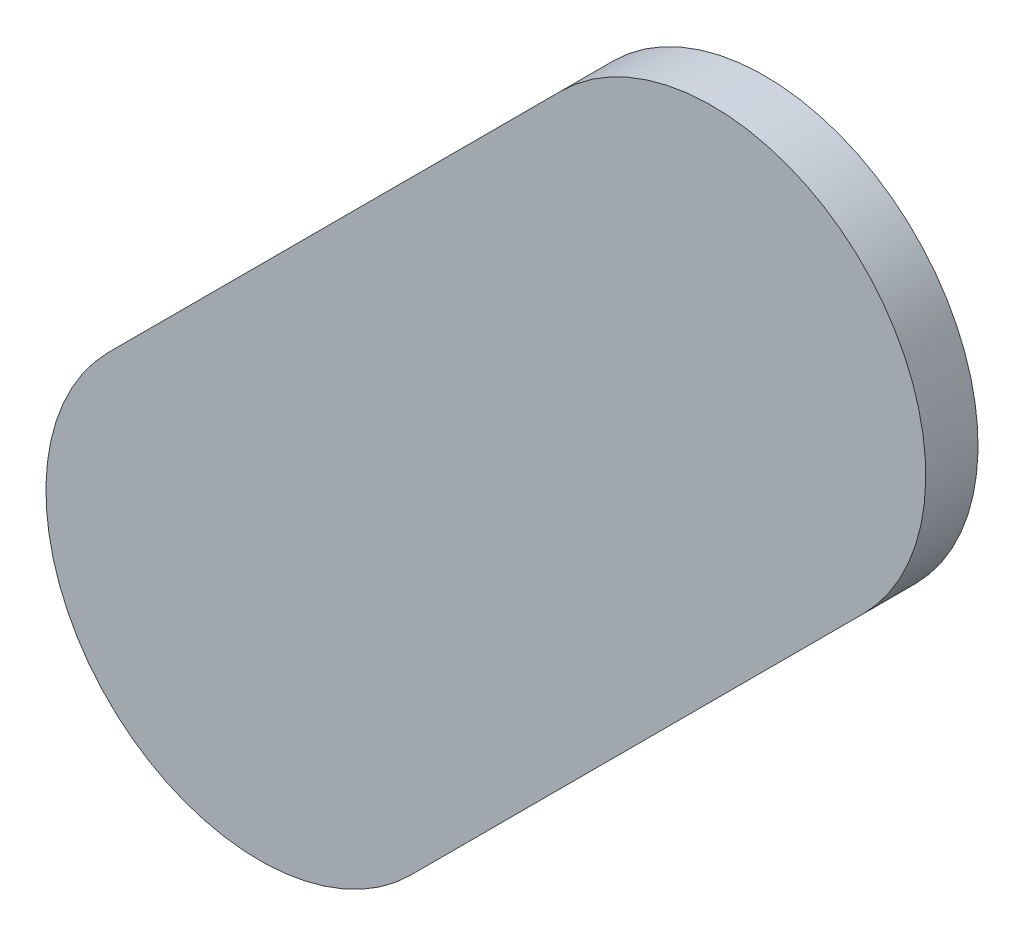
ISO-10303-21;
HEADER;
FILE_DESCRIPTION(('STEP AP214'),'2;1');
FILE_NAME('part.step','',(''),(''),'','','');
FILE_SCHEMA(('AUTOMOTIVE_DESIGN { 1 0 10303 214 1 1 1 1 }'));
ENDSEC;
DATA;
#1=APPLICATION_CONTEXT('core data for automotive mechanical design processes');
#2=APPLICATION_PROTOCOL_DEFINITION('international standard','automotive_design',2000,#1);
#3=PRODUCT_CONTEXT('',#1,'mechanical');
#4=PRODUCT('Part','Part','',(#3));
#5=PRODUCT_RELATED_PRODUCT_CATEGORY('part','',(#4));
#6=PRODUCT_DEFINITION_FORMATION('','',#4);
#7=PRODUCT_DEFINITION_CONTEXT('part definition',#1,'design');
#8=PRODUCT_DEFINITION('design','',#6,#7);
#9=PRODUCT_DEFINITION_SHAPE('','',#8);
#10=(LENGTH_UNIT() NAMED_UNIT(*) SI_UNIT(.MILLI.,.METRE.));
#11=(NAMED_UNIT(*) PLANE_ANGLE_UNIT() SI_UNIT($,.RADIAN.));
#12=(NAMED_UNIT(*) SI_UNIT($,.STERADIAN.) SOLID_ANGLE_UNIT());
#13=UNCERTAINTY_MEASURE_WITH_UNIT(LENGTH_MEASURE(1.E-05),#10,'distance_accuracy_value','');
#14=(GEOMETRIC_REPRESENTATION_CONTEXT(3) GLOBAL_UNCERTAINTY_ASSIGNED_CONTEXT((#13)) GLOBAL_UNIT_ASSIGNED_CONTEXT((#10,
#11,#12)) REPRESENTATION_CONTEXT('',''));
#15=CARTESIAN_POINT('',(0.,0.,0.));
#16=DIRECTION('',(0.,0.,1.));
#17=DIRECTION('',(1.,0.,0.));
#18=AXIS2_PLACEMENT_3D('',#15,#16,#17);
#19=CARTESIAN_POINT('',(6.130198089748,7.677965311465,0.79916));
#20=DIRECTION('',(0.,0.,1.));
#21=DIRECTION('',(1.,0.,0.));
#22=AXIS2_PLACEMENT_3D('',#19,#20,#21);
#23=PLANE('',#22);
#24=CARTESIAN_POINT('',(5.981705333,7.529472667,0.79916));
#25=DIRECTION('',(0.,0.,1.));
#26=DIRECTION('',(1.,0.,0.));
#27=AXIS2_PLACEMENT_3D('',#24,#25,#26);
#28=CIRCLE('',#27,0.139999666);
#29=CARTESIAN_POINT('',(6.08070065012217,7.43047798312202,0.79916));
#30=VERTEX_POINT('',#29);
#31=CARTESIAN_POINT('',(5.88271073875643,7.62846749914002,0.79916));
#32=VERTEX_POINT('',#31);
#33=EDGE_CURVE('E20',#30,#32,#28,.F.);
#34=ORIENTED_EDGE('',*,*,#33,.F.);
#35=DIRECTION('',(-0.707106660628037,-0.707106901745037,0.));
#36=VECTOR('',#35,1.);
#37=CARTESIAN_POINT('',(6.377685282866,7.727462717135,0.79916));
#38=LINE('',#37,#36);
#39=CARTESIAN_POINT('',(6.37768545805482,7.72746289232388,0.79916));
#40=VERTEX_POINT('',#39);
#41=EDGE_CURVE('E65',#30,#40,#38,.F.);
#42=ORIENTED_EDGE('',*,*,#41,.T.);
#43=CARTESIAN_POINT('',(6.278690333,7.826457768268,0.79916));
#44=DIRECTION('',(0.,0.,1.));
#45=DIRECTION('',(1.,0.,0.));
#46=AXIS2_PLACEMENT_3D('',#43,#44,#45);
#47=CIRCLE('',#46,0.14);
#48=CARTESIAN_POINT('',(6.17969531051548,7.92545264451574,0.79916));
#49=VERTEX_POINT('',#48);
#50=EDGE_CURVE('E57',#49,#40,#47,.F.);
#51=ORIENTED_EDGE('',*,*,#50,.F.);
#52=DIRECTION('',(0.707106098309218,0.707107464063218,0.));
#53=VECTOR('',#52,1.);
#54=CARTESIAN_POINT('',(5.882710953307,7.628467713691,0.79916));
#55=LINE('',#54,#53);
#56=EDGE_CURVE('E64',#49,#32,#55,.F.);
#57=ORIENTED_EDGE('',*,*,#56,.T.);
#58=EDGE_LOOP('',(#34,#42,#51,#57));
#59=FACE_BOUND('',#58,.T.);
#60=ADVANCED_FACE('F17',(#59),#23,.T.);
#61=CARTESIAN_POINT('',(6.377685282866,7.727462717135,0.76487));
#62=DIRECTION('',(-0.707106901745037,0.707106660628037,0.));
#63=DIRECTION('',(-0.707106660628037,-0.707106901745037,0.));
#64=AXIS2_PLACEMENT_3D('',#61,#62,#63);
#65=PLANE('',#64);
#66=DIRECTION('',(0.,0.,1.));
#67=VECTOR('',#66,1.);
#68=CARTESIAN_POINT('',(6.0807006670001,7.4304779999999,0.76487));
#69=LINE('',#68,#67);
#70=CARTESIAN_POINT('',(6.08070065012214,7.43047798312203,0.76487));
#71=VERTEX_POINT('',#70);
#72=EDGE_CURVE('E68',#71,#30,#69,.T.);
#73=ORIENTED_EDGE('',*,*,#72,.F.);
#74=DIRECTION('',(-0.707106660628128,-0.707106901744947,0.));
#75=VECTOR('',#74,1.);
#76=CARTESIAN_POINT('',(6.377685282866,7.727462717135,0.76487));
#77=LINE('',#76,#75);
#78=CARTESIAN_POINT('',(6.37768545805481,7.72746289232387,0.76487));
#79=VERTEX_POINT('',#78);
#80=EDGE_CURVE('E72',#79,#71,#77,.T.);
#81=ORIENTED_EDGE('',*,*,#80,.F.);
#82=DIRECTION('',(0.,0.,1.));
#83=VECTOR('',#82,1.);
#84=CARTESIAN_POINT('',(6.377685282866,7.727462717135,0.76487));
#85=LINE('',#84,#83);
#86=EDGE_CURVE('E60',#40,#79,#85,.F.);
#87=ORIENTED_EDGE('',*,*,#86,.F.);
#88=ORIENTED_EDGE('',*,*,#41,.F.);
#89=EDGE_LOOP('',(#73,#81,#87,#88));
#90=FACE_BOUND('',#89,.T.);
#91=ADVANCED_FACE('F70',(#90),#65,.F.);
#92=CARTESIAN_POINT('',(5.981705333,7.529472667,0.76487));
#93=DIRECTION('',(0.,0.,1.));
#94=DIRECTION('',(1.,0.,0.));
#95=AXIS2_PLACEMENT_3D('',#92,#93,#94);
#96=CYLINDRICAL_SURFACE('',#95,0.139999666);
#97=DIRECTION('',(0.,0.,1.));
#98=VECTOR('',#97,1.);
#99=CARTESIAN_POINT('',(5.882710953307,7.628467713691,0.76487));
#100=LINE('',#99,#98);
#101=CARTESIAN_POINT('',(5.88271073875646,7.62846749914004,0.76487));
#102=VERTEX_POINT('',#101);
#103=EDGE_CURVE('E77',#32,#102,#100,.F.);
#104=ORIENTED_EDGE('',*,*,#103,.T.);
#105=CARTESIAN_POINT('',(5.981705667,7.529472898732,0.76487));
#106=DIRECTION('',(0.,0.,1.));
#107=DIRECTION('',(1.,0.,0.));
#108=AXIS2_PLACEMENT_3D('',#105,#106,#107);
#109=CIRCLE('',#108,0.14);
#110=EDGE_CURVE('E26',#71,#102,#109,.F.);
#111=ORIENTED_EDGE('',*,*,#110,.F.);
#112=ORIENTED_EDGE('',*,*,#72,.T.);
#113=ORIENTED_EDGE('',*,*,#33,.T.);
#114=EDGE_LOOP('',(#104,#111,#112,#113));
#115=FACE_BOUND('',#114,.T.);
#116=ADVANCED_FACE('F88',(#115),#96,.T.);
#117=CARTESIAN_POINT('',(5.882710953307,7.628467713691,0.76487));
#118=DIRECTION('',(0.707107464063218,-0.707106098309218,0.));
#119=DIRECTION('',(0.707106098309218,0.707107464063218,0.));
#120=AXIS2_PLACEMENT_3D('',#117,#118,#119);
#121=PLANE('',#120);
#122=DIRECTION('',(0.,0.,1.));
#123=VECTOR('',#122,1.);
#124=CARTESIAN_POINT('',(6.1796953329999,7.9254526670001,0.76487));
#125=LINE('',#124,#123);
#126=CARTESIAN_POINT('',(6.17969531051561,7.92545264451567,0.76487));
#127=VERTEX_POINT('',#126);
#128=EDGE_CURVE('E62',#127,#49,#125,.T.);
#129=ORIENTED_EDGE('',*,*,#128,.F.);
#130=DIRECTION('',(0.70710609830961,0.707107464062826,0.));
#131=VECTOR('',#130,1.);
#132=CARTESIAN_POINT('',(5.882710953307,7.628467713691,0.76487));
#133=LINE('',#132,#131);
#134=EDGE_CURVE('E11',#102,#127,#133,.T.);
#135=ORIENTED_EDGE('',*,*,#134,.F.);
#136=ORIENTED_EDGE('',*,*,#103,.F.);
#137=ORIENTED_EDGE('',*,*,#56,.F.);
#138=EDGE_LOOP('',(#129,#135,#136,#137));
#139=FACE_BOUND('',#138,.T.);
#140=ADVANCED_FACE('F96',(#139),#121,.F.);
#141=CARTESIAN_POINT('',(6.278690333,7.826457768268,0.76487));
#142=DIRECTION('',(0.,0.,1.));
#143=DIRECTION('',(1.,0.,0.));
#144=AXIS2_PLACEMENT_3D('',#141,#142,#143);
#145=CYLINDRICAL_SURFACE('',#144,0.14);
#146=CARTESIAN_POINT('',(6.278690667,7.826458,0.76487));
#147=DIRECTION('',(0.,0.,1.));
#148=DIRECTION('',(1.,0.,0.));
#149=AXIS2_PLACEMENT_3D('',#146,#147,#148);
#150=CIRCLE('',#149,0.14);
#151=EDGE_CURVE('E35',#127,#79,#150,.F.);
#152=ORIENTED_EDGE('',*,*,#151,.F.);
#153=ORIENTED_EDGE('',*,*,#128,.T.);
#154=ORIENTED_EDGE('',*,*,#50,.T.);
#155=ORIENTED_EDGE('',*,*,#86,.T.);
#156=EDGE_LOOP('',(#152,#153,#154,#155));
#157=FACE_BOUND('',#156,.T.);
#158=ADVANCED_FACE('F58',(#157),#145,.T.);
#159=CARTESIAN_POINT('',(6.130198089748,7.677965311465,0.76487));
#160=DIRECTION('',(0.,0.,-1.));
#161=DIRECTION('',(-1.,0.,0.));
#162=AXIS2_PLACEMENT_3D('',#159,#160,#161);
#163=PLANE('',#162);
#164=ORIENTED_EDGE('',*,*,#134,.T.);
#165=ORIENTED_EDGE('',*,*,#151,.T.);
#166=ORIENTED_EDGE('',*,*,#80,.T.);
#167=ORIENTED_EDGE('',*,*,#110,.T.);
#168=EDGE_LOOP('',(#164,#165,#166,#167));
#169=FACE_BOUND('',#168,.T.);
#170=ADVANCED_FACE('F89',(#169),#163,.T.);
#171=CLOSED_SHELL('',(#60,#91,#116,#140,#158,#170));
#172=MANIFOLD_SOLID_BREP('B1',#171);
#173=ADVANCED_BREP_SHAPE_REPRESENTATION('',(#18,#172),#14);
#174=SHAPE_DEFINITION_REPRESENTATION(#9,#173);
ENDSEC;
END-ISO-10303-21;
